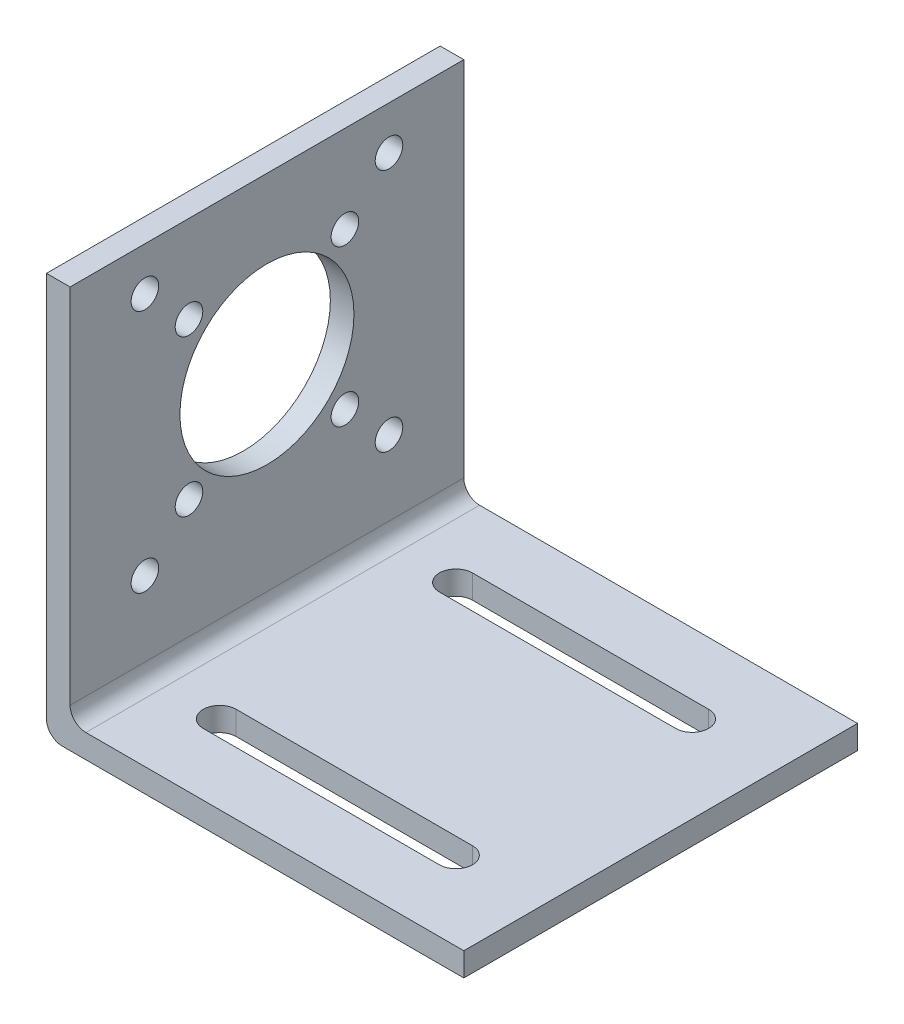
ISO-10303-21;
HEADER;
FILE_DESCRIPTION(('STEP AP214'),'2;1');
FILE_NAME('part.step','',(''),(''),'','','');
FILE_SCHEMA(('AUTOMOTIVE_DESIGN { 1 0 10303 214 1 1 1 1 }'));
ENDSEC;
DATA;
#1=APPLICATION_CONTEXT('core data for automotive mechanical design processes');
#2=APPLICATION_PROTOCOL_DEFINITION('international standard','automotive_design',2000,#1);
#3=PRODUCT_CONTEXT('',#1,'mechanical');
#4=PRODUCT('Part','Part','',(#3));
#5=PRODUCT_RELATED_PRODUCT_CATEGORY('part','',(#4));
#6=PRODUCT_DEFINITION_FORMATION('','',#4);
#7=PRODUCT_DEFINITION_CONTEXT('part definition',#1,'design');
#8=PRODUCT_DEFINITION('design','',#6,#7);
#9=PRODUCT_DEFINITION_SHAPE('','',#8);
#10=(LENGTH_UNIT() NAMED_UNIT(*) SI_UNIT(.MILLI.,.METRE.));
#11=(NAMED_UNIT(*) PLANE_ANGLE_UNIT() SI_UNIT($,.RADIAN.));
#12=(NAMED_UNIT(*) SI_UNIT($,.STERADIAN.) SOLID_ANGLE_UNIT());
#13=UNCERTAINTY_MEASURE_WITH_UNIT(LENGTH_MEASURE(1.E-05),#10,'distance_accuracy_value','');
#14=(GEOMETRIC_REPRESENTATION_CONTEXT(3) GLOBAL_UNCERTAINTY_ASSIGNED_CONTEXT((#13)) GLOBAL_UNIT_ASSIGNED_CONTEXT((#10,
#11,#12)) REPRESENTATION_CONTEXT('',''));
#15=CARTESIAN_POINT('',(0.,0.,0.));
#16=DIRECTION('',(0.,0.,1.));
#17=DIRECTION('',(1.,0.,0.));
#18=AXIS2_PLACEMENT_3D('',#15,#16,#17);
#19=CARTESIAN_POINT('',(0.,3.,0.));
#20=DIRECTION('',(0.,-1.,0.));
#21=DIRECTION('',(0.,0.,-1.));
#22=AXIS2_PLACEMENT_3D('',#19,#20,#21);
#23=PLANE('',#22);
#24=CARTESIAN_POINT('',(42.,3.,-40.));
#25=DIRECTION('',(0.,1.,0.));
#26=DIRECTION('',(0.,0.,1.));
#27=AXIS2_PLACEMENT_3D('',#24,#25,#26);
#28=CIRCLE('',#27,2.1);
#29=CARTESIAN_POINT('',(42.,3.,-37.9));
#30=VERTEX_POINT('',#29);
#31=CARTESIAN_POINT('',(42.,3.,-42.1));
#32=VERTEX_POINT('',#31);
#33=EDGE_CURVE('E231',#30,#32,#28,.T.);
#34=ORIENTED_EDGE('',*,*,#33,.F.);
#35=DIRECTION('',(1.,0.,0.));
#36=VECTOR('',#35,1.);
#37=CARTESIAN_POINT('',(0.,3.,-37.9));
#38=LINE('',#37,#36);
#39=CARTESIAN_POINT('',(12.,3.,-37.9));
#40=VERTEX_POINT('',#39);
#41=EDGE_CURVE('E202',#40,#30,#38,.T.);
#42=ORIENTED_EDGE('',*,*,#41,.F.);
#43=CARTESIAN_POINT('',(12.,3.,-40.));
#44=DIRECTION('',(0.,1.,0.));
#45=DIRECTION('',(0.,0.,1.));
#46=AXIS2_PLACEMENT_3D('',#43,#44,#45);
#47=CIRCLE('',#46,2.1);
#48=CARTESIAN_POINT('',(12.,3.,-42.1));
#49=VERTEX_POINT('',#48);
#50=EDGE_CURVE('E219',#49,#40,#47,.T.);
#51=ORIENTED_EDGE('',*,*,#50,.F.);
#52=DIRECTION('',(1.,0.,0.));
#53=VECTOR('',#52,1.);
#54=CARTESIAN_POINT('',(0.,3.,-42.1));
#55=LINE('',#54,#53);
#56=EDGE_CURVE('E222',#49,#32,#55,.T.);
#57=ORIENTED_EDGE('',*,*,#56,.T.);
#58=EDGE_LOOP('',(#34,#42,#51,#57));
#59=FACE_BOUND('',#58,.T.);
#60=DIRECTION('',(-1.,0.,0.));
#61=VECTOR('',#60,1.);
#62=CARTESIAN_POINT('',(0.,3.,-50.));
#63=LINE('',#62,#61);
#64=CARTESIAN_POINT('',(53.,3.,-50.));
#65=VERTEX_POINT('',#64);
#66=CARTESIAN_POINT('',(5.,3.,-50.));
#67=VERTEX_POINT('',#66);
#68=EDGE_CURVE('E294',#65,#67,#63,.T.);
#69=ORIENTED_EDGE('',*,*,#68,.T.);
#70=DIRECTION('',(0.,0.,-1.));
#71=VECTOR('',#70,1.);
#72=CARTESIAN_POINT('',(5.,3.,0.));
#73=LINE('',#72,#71);
#74=CARTESIAN_POINT('',(5.,3.,0.));
#75=VERTEX_POINT('',#74);
#76=EDGE_CURVE('E315',#67,#75,#73,.F.);
#77=ORIENTED_EDGE('',*,*,#76,.T.);
#78=DIRECTION('',(1.,0.,0.));
#79=VECTOR('',#78,1.);
#80=CARTESIAN_POINT('',(0.,3.,0.));
#81=LINE('',#80,#79);
#82=CARTESIAN_POINT('',(53.,3.,0.));
#83=VERTEX_POINT('',#82);
#84=EDGE_CURVE('E289',#75,#83,#81,.T.);
#85=ORIENTED_EDGE('',*,*,#84,.T.);
#86=DIRECTION('',(0.,0.,-1.));
#87=VECTOR('',#86,1.);
#88=CARTESIAN_POINT('',(53.,3.,0.));
#89=LINE('',#88,#87);
#90=EDGE_CURVE('E291',#83,#65,#89,.T.);
#91=ORIENTED_EDGE('',*,*,#90,.T.);
#92=EDGE_LOOP('',(#69,#77,#85,#91));
#93=FACE_BOUND('',#92,.T.);
#94=CARTESIAN_POINT('',(42.,3.,-10.));
#95=DIRECTION('',(0.,1.,0.));
#96=DIRECTION('',(0.,0.,1.));
#97=AXIS2_PLACEMENT_3D('',#94,#95,#96);
#98=CIRCLE('',#97,2.1);
#99=CARTESIAN_POINT('',(42.,3.,-12.1));
#100=VERTEX_POINT('',#99);
#101=CARTESIAN_POINT('',(42.,3.,-7.90000000000001));
#102=VERTEX_POINT('',#101);
#103=EDGE_CURVE('E254',#100,#102,#98,.F.);
#104=ORIENTED_EDGE('',*,*,#103,.T.);
#105=DIRECTION('',(1.,0.,0.));
#106=VECTOR('',#105,1.);
#107=CARTESIAN_POINT('',(0.,3.,-7.90000000000001));
#108=LINE('',#107,#106);
#109=CARTESIAN_POINT('',(12.,3.,-7.90000000000001));
#110=VERTEX_POINT('',#109);
#111=EDGE_CURVE('E245',#110,#102,#108,.T.);
#112=ORIENTED_EDGE('',*,*,#111,.F.);
#113=CARTESIAN_POINT('',(12.,3.,-10.));
#114=DIRECTION('',(0.,1.,0.));
#115=DIRECTION('',(0.,0.,1.));
#116=AXIS2_PLACEMENT_3D('',#113,#114,#115);
#117=CIRCLE('',#116,2.1);
#118=CARTESIAN_POINT('',(12.,3.,-12.1));
#119=VERTEX_POINT('',#118);
#120=EDGE_CURVE('E261',#110,#119,#117,.F.);
#121=ORIENTED_EDGE('',*,*,#120,.T.);
#122=DIRECTION('',(1.,0.,0.));
#123=VECTOR('',#122,1.);
#124=CARTESIAN_POINT('',(0.,3.,-12.1));
#125=LINE('',#124,#123);
#126=EDGE_CURVE('E257',#119,#100,#125,.T.);
#127=ORIENTED_EDGE('',*,*,#126,.T.);
#128=EDGE_LOOP('',(#104,#112,#121,#127));
#129=FACE_BOUND('',#128,.T.);
#130=ADVANCED_FACE('F82',(#59,#93,#129),#23,.F.);
#131=CARTESIAN_POINT('',(0.,0.,0.));
#132=DIRECTION('',(0.,-1.,0.));
#133=DIRECTION('',(0.,0.,-1.));
#134=AXIS2_PLACEMENT_3D('',#131,#132,#133);
#135=PLANE('',#134);
#136=DIRECTION('',(1.,0.,0.));
#137=VECTOR('',#136,1.);
#138=CARTESIAN_POINT('',(0.,0.,-37.9));
#139=LINE('',#138,#137);
#140=CARTESIAN_POINT('',(12.,0.,-37.9));
#141=VERTEX_POINT('',#140);
#142=CARTESIAN_POINT('',(42.,0.,-37.9));
#143=VERTEX_POINT('',#142);
#144=EDGE_CURVE('E199',#141,#143,#139,.T.);
#145=ORIENTED_EDGE('',*,*,#144,.T.);
#146=CARTESIAN_POINT('',(42.,0.,-40.));
#147=DIRECTION('',(0.,1.,0.));
#148=DIRECTION('',(0.,0.,1.));
#149=AXIS2_PLACEMENT_3D('',#146,#147,#148);
#150=CIRCLE('',#149,2.1);
#151=CARTESIAN_POINT('',(42.,0.,-42.1));
#152=VERTEX_POINT('',#151);
#153=EDGE_CURVE('E210',#143,#152,#150,.T.);
#154=ORIENTED_EDGE('',*,*,#153,.T.);
#155=DIRECTION('',(1.,0.,0.));
#156=VECTOR('',#155,1.);
#157=CARTESIAN_POINT('',(0.,0.,-42.1));
#158=LINE('',#157,#156);
#159=CARTESIAN_POINT('',(12.,0.,-42.1));
#160=VERTEX_POINT('',#159);
#161=EDGE_CURVE('E215',#160,#152,#158,.T.);
#162=ORIENTED_EDGE('',*,*,#161,.F.);
#163=CARTESIAN_POINT('',(12.,0.,-40.));
#164=DIRECTION('',(0.,1.,0.));
#165=DIRECTION('',(0.,0.,1.));
#166=AXIS2_PLACEMENT_3D('',#163,#164,#165);
#167=CIRCLE('',#166,2.1);
#168=EDGE_CURVE('E207',#160,#141,#167,.T.);
#169=ORIENTED_EDGE('',*,*,#168,.T.);
#170=EDGE_LOOP('',(#145,#154,#162,#169));
#171=FACE_BOUND('',#170,.T.);
#172=DIRECTION('',(1.,0.,0.));
#173=VECTOR('',#172,1.);
#174=CARTESIAN_POINT('',(0.,0.,0.));
#175=LINE('',#174,#173);
#176=CARTESIAN_POINT('',(2.,0.,0.));
#177=VERTEX_POINT('',#176);
#178=CARTESIAN_POINT('',(53.,0.,0.));
#179=VERTEX_POINT('',#178);
#180=EDGE_CURVE('E288',#177,#179,#175,.T.);
#181=ORIENTED_EDGE('',*,*,#180,.F.);
#182=DIRECTION('',(0.,0.,1.));
#183=VECTOR('',#182,1.);
#184=CARTESIAN_POINT('',(2.,0.,-50.));
#185=LINE('',#184,#183);
#186=CARTESIAN_POINT('',(2.,0.,-50.));
#187=VERTEX_POINT('',#186);
#188=EDGE_CURVE('E97',#177,#187,#185,.F.);
#189=ORIENTED_EDGE('',*,*,#188,.T.);
#190=DIRECTION('',(-1.,0.,0.));
#191=VECTOR('',#190,1.);
#192=CARTESIAN_POINT('',(0.,0.,-50.));
#193=LINE('',#192,#191);
#194=CARTESIAN_POINT('',(53.,0.,-50.));
#195=VERTEX_POINT('',#194);
#196=EDGE_CURVE('E292',#195,#187,#193,.T.);
#197=ORIENTED_EDGE('',*,*,#196,.F.);
#198=DIRECTION('',(0.,0.,-1.));
#199=VECTOR('',#198,1.);
#200=CARTESIAN_POINT('',(53.,0.,0.));
#201=LINE('',#200,#199);
#202=EDGE_CURVE('E299',#179,#195,#201,.T.);
#203=ORIENTED_EDGE('',*,*,#202,.F.);
#204=EDGE_LOOP('',(#181,#189,#197,#203));
#205=FACE_BOUND('',#204,.T.);
#206=DIRECTION('',(1.,0.,0.));
#207=VECTOR('',#206,1.);
#208=CARTESIAN_POINT('',(0.,0.,-7.90000000000001));
#209=LINE('',#208,#207);
#210=CARTESIAN_POINT('',(12.,0.,-7.90000000000001));
#211=VERTEX_POINT('',#210);
#212=CARTESIAN_POINT('',(42.,0.,-7.90000000000001));
#213=VERTEX_POINT('',#212);
#214=EDGE_CURVE('E250',#211,#213,#209,.T.);
#215=ORIENTED_EDGE('',*,*,#214,.T.);
#216=CARTESIAN_POINT('',(42.,0.,-10.));
#217=DIRECTION('',(0.,1.,0.));
#218=DIRECTION('',(0.,0.,1.));
#219=AXIS2_PLACEMENT_3D('',#216,#217,#218);
#220=CIRCLE('',#219,2.1);
#221=CARTESIAN_POINT('',(42.,0.,-12.1));
#222=VERTEX_POINT('',#221);
#223=EDGE_CURVE('E242',#222,#213,#220,.F.);
#224=ORIENTED_EDGE('',*,*,#223,.F.);
#225=DIRECTION('',(1.,0.,0.));
#226=VECTOR('',#225,1.);
#227=CARTESIAN_POINT('',(0.,0.,-12.1));
#228=LINE('',#227,#226);
#229=CARTESIAN_POINT('',(12.,0.,-12.1));
#230=VERTEX_POINT('',#229);
#231=EDGE_CURVE('E244',#230,#222,#228,.T.);
#232=ORIENTED_EDGE('',*,*,#231,.F.);
#233=CARTESIAN_POINT('',(12.,0.,-10.));
#234=DIRECTION('',(0.,1.,0.));
#235=DIRECTION('',(0.,0.,1.));
#236=AXIS2_PLACEMENT_3D('',#233,#234,#235);
#237=CIRCLE('',#236,2.1);
#238=EDGE_CURVE('E247',#211,#230,#237,.F.);
#239=ORIENTED_EDGE('',*,*,#238,.F.);
#240=EDGE_LOOP('',(#215,#224,#232,#239));
#241=FACE_BOUND('',#240,.T.);
#242=ADVANCED_FACE('F217',(#171,#205,#241),#135,.T.);
#243=CARTESIAN_POINT('',(0.,3.,0.));
#244=DIRECTION('',(1.,0.,0.));
#245=DIRECTION('',(0.,0.,-1.));
#246=AXIS2_PLACEMENT_3D('',#243,#244,#245);
#247=PLANE('',#246);
#248=CARTESIAN_POINT('',(0.,14.5,-9.5));
#249=DIRECTION('',(1.,0.,0.));
#250=DIRECTION('',(0.,0.,-1.));
#251=AXIS2_PLACEMENT_3D('',#248,#249,#250);
#252=CIRCLE('',#251,1.75);
#253=CARTESIAN_POINT('',(0.,14.5,-11.25));
#254=VERTEX_POINT('',#253);
#255=EDGE_CURVE('E451',#254,#254,#252,.T.);
#256=ORIENTED_EDGE('',*,*,#255,.T.);
#257=EDGE_LOOP('',(#256));
#258=FACE_BOUND('',#257,.T.);
#259=CARTESIAN_POINT('',(0.,20.1,-15.1010101525459));
#260=DIRECTION('',(1.,0.,0.));
#261=DIRECTION('',(0.,0.,-1.));
#262=AXIS2_PLACEMENT_3D('',#259,#260,#261);
#263=CIRCLE('',#262,1.75);
#264=CARTESIAN_POINT('',(0.,20.1,-16.8510101525459));
#265=VERTEX_POINT('',#264);
#266=EDGE_CURVE('E480',#265,#265,#263,.T.);
#267=ORIENTED_EDGE('',*,*,#266,.T.);
#268=EDGE_LOOP('',(#267));
#269=FACE_BOUND('',#268,.T.);
#270=CARTESIAN_POINT('',(0.,39.9,-15.1010101525459));
#271=DIRECTION('',(1.,0.,0.));
#272=DIRECTION('',(0.,0.,-1.));
#273=AXIS2_PLACEMENT_3D('',#270,#271,#272);
#274=CIRCLE('',#273,1.75);
#275=CARTESIAN_POINT('',(0.,39.9,-16.8510101525459));
#276=VERTEX_POINT('',#275);
#277=EDGE_CURVE('E488',#276,#276,#274,.T.);
#278=ORIENTED_EDGE('',*,*,#277,.T.);
#279=EDGE_LOOP('',(#278));
#280=FACE_BOUND('',#279,.T.);
#281=CARTESIAN_POINT('',(0.,30.,-25.));
#282=DIRECTION('',(1.,0.,0.));
#283=DIRECTION('',(0.,0.,-1.));
#284=AXIS2_PLACEMENT_3D('',#281,#282,#283);
#285=CIRCLE('',#284,11.05);
#286=CARTESIAN_POINT('',(0.,30.,-36.05));
#287=VERTEX_POINT('',#286);
#288=EDGE_CURVE('E479',#287,#287,#285,.T.);
#289=ORIENTED_EDGE('',*,*,#288,.T.);
#290=EDGE_LOOP('',(#289));
#291=FACE_BOUND('',#290,.T.);
#292=CARTESIAN_POINT('',(0.,20.1,-34.8989898474541));
#293=DIRECTION('',(1.,0.,0.));
#294=DIRECTION('',(0.,0.,-1.));
#295=AXIS2_PLACEMENT_3D('',#292,#293,#294);
#296=CIRCLE('',#295,1.75);
#297=CARTESIAN_POINT('',(0.,20.1,-36.6489898474541));
#298=VERTEX_POINT('',#297);
#299=EDGE_CURVE('E446',#298,#298,#296,.T.);
#300=ORIENTED_EDGE('',*,*,#299,.T.);
#301=EDGE_LOOP('',(#300));
#302=FACE_BOUND('',#301,.T.);
#303=CARTESIAN_POINT('',(0.,14.5,-40.5));
#304=DIRECTION('',(1.,0.,0.));
#305=DIRECTION('',(0.,0.,-1.));
#306=AXIS2_PLACEMENT_3D('',#303,#304,#305);
#307=CIRCLE('',#306,1.75);
#308=CARTESIAN_POINT('',(0.,14.5,-42.25));
#309=VERTEX_POINT('',#308);
#310=EDGE_CURVE('E461',#309,#309,#307,.T.);
#311=ORIENTED_EDGE('',*,*,#310,.T.);
#312=EDGE_LOOP('',(#311));
#313=FACE_BOUND('',#312,.T.);
#314=CARTESIAN_POINT('',(0.,39.9,-34.8989898474541));
#315=DIRECTION('',(1.,0.,0.));
#316=DIRECTION('',(0.,0.,-1.));
#317=AXIS2_PLACEMENT_3D('',#314,#315,#316);
#318=CIRCLE('',#317,1.75);
#319=CARTESIAN_POINT('',(0.,39.9,-36.6489898474541));
#320=VERTEX_POINT('',#319);
#321=EDGE_CURVE('E467',#320,#320,#318,.T.);
#322=ORIENTED_EDGE('',*,*,#321,.T.);
#323=EDGE_LOOP('',(#322));
#324=FACE_BOUND('',#323,.T.);
#325=CARTESIAN_POINT('',(0.,45.5,-40.5));
#326=DIRECTION('',(1.,0.,0.));
#327=DIRECTION('',(0.,0.,-1.));
#328=AXIS2_PLACEMENT_3D('',#325,#326,#327);
#329=CIRCLE('',#328,1.75);
#330=CARTESIAN_POINT('',(0.,45.5,-42.25));
#331=VERTEX_POINT('',#330);
#332=EDGE_CURVE('E473',#331,#331,#329,.T.);
#333=ORIENTED_EDGE('',*,*,#332,.T.);
#334=EDGE_LOOP('',(#333));
#335=FACE_BOUND('',#334,.T.);
#336=CARTESIAN_POINT('',(0.,45.5,-9.5));
#337=DIRECTION('',(1.,0.,0.));
#338=DIRECTION('',(0.,0.,-1.));
#339=AXIS2_PLACEMENT_3D('',#336,#337,#338);
#340=CIRCLE('',#339,1.75);
#341=CARTESIAN_POINT('',(0.,45.5,-11.25));
#342=VERTEX_POINT('',#341);
#343=EDGE_CURVE('E258',#342,#342,#340,.T.);
#344=ORIENTED_EDGE('',*,*,#343,.T.);
#345=EDGE_LOOP('',(#344));
#346=FACE_BOUND('',#345,.T.);
#347=DIRECTION('',(0.,-1.,0.));
#348=VECTOR('',#347,1.);
#349=CARTESIAN_POINT('',(0.,3.,-50.));
#350=LINE('',#349,#348);
#351=CARTESIAN_POINT('',(0.,51.,-50.));
#352=VERTEX_POINT('',#351);
#353=CARTESIAN_POINT('',(0.,2.,-50.));
#354=VERTEX_POINT('',#353);
#355=EDGE_CURVE('E297',#352,#354,#350,.T.);
#356=ORIENTED_EDGE('',*,*,#355,.T.);
#357=DIRECTION('',(0.,0.,1.));
#358=VECTOR('',#357,1.);
#359=CARTESIAN_POINT('',(0.,2.,0.));
#360=LINE('',#359,#358);
#361=CARTESIAN_POINT('',(0.,2.,0.));
#362=VERTEX_POINT('',#361);
#363=EDGE_CURVE('E317',#354,#362,#360,.T.);
#364=ORIENTED_EDGE('',*,*,#363,.T.);
#365=DIRECTION('',(0.,-1.,0.));
#366=VECTOR('',#365,1.);
#367=CARTESIAN_POINT('',(0.,3.,0.));
#368=LINE('',#367,#366);
#369=CARTESIAN_POINT('',(0.,51.,0.));
#370=VERTEX_POINT('',#369);
#371=EDGE_CURVE('E310',#370,#362,#368,.T.);
#372=ORIENTED_EDGE('',*,*,#371,.F.);
#373=DIRECTION('',(0.,0.,1.));
#374=VECTOR('',#373,1.);
#375=CARTESIAN_POINT('',(0.,51.,0.));
#376=LINE('',#375,#374);
#377=EDGE_CURVE('E238',#352,#370,#376,.T.);
#378=ORIENTED_EDGE('',*,*,#377,.F.);
#379=EDGE_LOOP('',(#356,#364,#372,#378));
#380=FACE_BOUND('',#379,.T.);
#381=ADVANCED_FACE('F349',(#258,#269,#280,#291,#302,#313,#324,#335,#346,#380),#247,.F.);
#382=CARTESIAN_POINT('',(0.,3.,0.));
#383=DIRECTION('',(0.,0.,-1.));
#384=DIRECTION('',(-1.,0.,0.));
#385=AXIS2_PLACEMENT_3D('',#382,#383,#384);
#386=PLANE('',#385);
#387=ORIENTED_EDGE('',*,*,#371,.T.);
#388=CARTESIAN_POINT('',(2.,2.,0.));
#389=DIRECTION('',(0.,0.,-1.));
#390=DIRECTION('',(-1.,0.,0.));
#391=AXIS2_PLACEMENT_3D('',#388,#389,#390);
#392=CIRCLE('',#391,2.);
#393=EDGE_CURVE('E105',#362,#177,#392,.F.);
#394=ORIENTED_EDGE('',*,*,#393,.T.);
#395=ORIENTED_EDGE('',*,*,#180,.T.);
#396=DIRECTION('',(0.,-1.,0.));
#397=VECTOR('',#396,1.);
#398=CARTESIAN_POINT('',(53.,3.,0.));
#399=LINE('',#398,#397);
#400=EDGE_CURVE('E307',#83,#179,#399,.T.);
#401=ORIENTED_EDGE('',*,*,#400,.F.);
#402=ORIENTED_EDGE('',*,*,#84,.F.);
#403=CARTESIAN_POINT('',(5.,5.,0.));
#404=DIRECTION('',(0.,0.,-1.));
#405=DIRECTION('',(-1.,0.,0.));
#406=AXIS2_PLACEMENT_3D('',#403,#404,#405);
#407=CIRCLE('',#406,2.);
#408=CARTESIAN_POINT('',(3.,5.,0.));
#409=VERTEX_POINT('',#408);
#410=EDGE_CURVE('E14',#75,#409,#407,.T.);
#411=ORIENTED_EDGE('',*,*,#410,.T.);
#412=DIRECTION('',(0.,-1.,0.));
#413=VECTOR('',#412,1.);
#414=CARTESIAN_POINT('',(3.,51.,0.));
#415=LINE('',#414,#413);
#416=CARTESIAN_POINT('',(3.,51.,0.));
#417=VERTEX_POINT('',#416);
#418=EDGE_CURVE('E285',#417,#409,#415,.T.);
#419=ORIENTED_EDGE('',*,*,#418,.F.);
#420=DIRECTION('',(1.,0.,0.));
#421=VECTOR('',#420,1.);
#422=CARTESIAN_POINT('',(0.,51.,0.));
#423=LINE('',#422,#421);
#424=EDGE_CURVE('E275',#370,#417,#423,.T.);
#425=ORIENTED_EDGE('',*,*,#424,.F.);
#426=EDGE_LOOP('',(#387,#394,#395,#401,#402,#411,#419,#425));
#427=FACE_BOUND('',#426,.T.);
#428=ADVANCED_FACE('F339',(#427),#386,.F.);
#429=CARTESIAN_POINT('',(53.,3.,0.));
#430=DIRECTION('',(-1.,0.,0.));
#431=DIRECTION('',(0.,0.,1.));
#432=AXIS2_PLACEMENT_3D('',#429,#430,#431);
#433=PLANE('',#432);
#434=ORIENTED_EDGE('',*,*,#202,.T.);
#435=DIRECTION('',(0.,-1.,0.));
#436=VECTOR('',#435,1.);
#437=CARTESIAN_POINT('',(53.,3.,-50.));
#438=LINE('',#437,#436);
#439=EDGE_CURVE('E304',#65,#195,#438,.T.);
#440=ORIENTED_EDGE('',*,*,#439,.F.);
#441=ORIENTED_EDGE('',*,*,#90,.F.);
#442=ORIENTED_EDGE('',*,*,#400,.T.);
#443=EDGE_LOOP('',(#434,#440,#441,#442));
#444=FACE_BOUND('',#443,.T.);
#445=ADVANCED_FACE('F356',(#444),#433,.F.);
#446=CARTESIAN_POINT('',(0.,3.,-50.));
#447=DIRECTION('',(0.,0.,1.));
#448=DIRECTION('',(1.,0.,0.));
#449=AXIS2_PLACEMENT_3D('',#446,#447,#448);
#450=PLANE('',#449);
#451=ORIENTED_EDGE('',*,*,#196,.T.);
#452=CARTESIAN_POINT('',(2.,2.,-50.));
#453=DIRECTION('',(0.,0.,1.));
#454=DIRECTION('',(1.,0.,0.));
#455=AXIS2_PLACEMENT_3D('',#452,#453,#454);
#456=CIRCLE('',#455,2.);
#457=EDGE_CURVE('E322',#187,#354,#456,.F.);
#458=ORIENTED_EDGE('',*,*,#457,.T.);
#459=ORIENTED_EDGE('',*,*,#355,.F.);
#460=DIRECTION('',(-1.,0.,0.));
#461=VECTOR('',#460,1.);
#462=CARTESIAN_POINT('',(0.,51.,-50.));
#463=LINE('',#462,#461);
#464=CARTESIAN_POINT('',(3.,51.,-50.));
#465=VERTEX_POINT('',#464);
#466=EDGE_CURVE('E279',#465,#352,#463,.T.);
#467=ORIENTED_EDGE('',*,*,#466,.F.);
#468=DIRECTION('',(0.,-1.,0.));
#469=VECTOR('',#468,1.);
#470=CARTESIAN_POINT('',(3.,51.,-50.));
#471=LINE('',#470,#469);
#472=CARTESIAN_POINT('',(3.,5.,-50.));
#473=VERTEX_POINT('',#472);
#474=EDGE_CURVE('E282',#465,#473,#471,.T.);
#475=ORIENTED_EDGE('',*,*,#474,.T.);
#476=CARTESIAN_POINT('',(5.,5.,-50.));
#477=DIRECTION('',(0.,0.,1.));
#478=DIRECTION('',(1.,0.,0.));
#479=AXIS2_PLACEMENT_3D('',#476,#477,#478);
#480=CIRCLE('',#479,2.);
#481=EDGE_CURVE('E90',#473,#67,#480,.T.);
#482=ORIENTED_EDGE('',*,*,#481,.T.);
#483=ORIENTED_EDGE('',*,*,#68,.F.);
#484=ORIENTED_EDGE('',*,*,#439,.T.);
#485=EDGE_LOOP('',(#451,#458,#459,#467,#475,#482,#483,#484));
#486=FACE_BOUND('',#485,.T.);
#487=ADVANCED_FACE('F325',(#486),#450,.F.);
#488=CARTESIAN_POINT('',(3.,51.,0.));
#489=DIRECTION('',(-1.,0.,0.));
#490=DIRECTION('',(0.,0.,1.));
#491=AXIS2_PLACEMENT_3D('',#488,#489,#490);
#492=PLANE('',#491);
#493=CARTESIAN_POINT('',(3.,14.5,-9.5));
#494=DIRECTION('',(1.,0.,0.));
#495=DIRECTION('',(0.,0.,-1.));
#496=AXIS2_PLACEMENT_3D('',#493,#494,#495);
#497=CIRCLE('',#496,1.75);
#498=CARTESIAN_POINT('',(3.,14.5,-11.25));
#499=VERTEX_POINT('',#498);
#500=EDGE_CURVE('E454',#499,#499,#497,.T.);
#501=ORIENTED_EDGE('',*,*,#500,.F.);
#502=EDGE_LOOP('',(#501));
#503=FACE_BOUND('',#502,.T.);
#504=CARTESIAN_POINT('',(3.,20.1,-15.1010101525459));
#505=DIRECTION('',(1.,0.,0.));
#506=DIRECTION('',(0.,0.,-1.));
#507=AXIS2_PLACEMENT_3D('',#504,#505,#506);
#508=CIRCLE('',#507,1.75);
#509=CARTESIAN_POINT('',(3.,20.1,-16.8510101525459));
#510=VERTEX_POINT('',#509);
#511=EDGE_CURVE('E476',#510,#510,#508,.T.);
#512=ORIENTED_EDGE('',*,*,#511,.F.);
#513=EDGE_LOOP('',(#512));
#514=FACE_BOUND('',#513,.T.);
#515=CARTESIAN_POINT('',(3.,39.9,-15.1010101525459));
#516=DIRECTION('',(1.,0.,0.));
#517=DIRECTION('',(0.,0.,-1.));
#518=AXIS2_PLACEMENT_3D('',#515,#516,#517);
#519=CIRCLE('',#518,1.75);
#520=CARTESIAN_POINT('',(3.,39.9,-16.8510101525459));
#521=VERTEX_POINT('',#520);
#522=EDGE_CURVE('E491',#521,#521,#519,.T.);
#523=ORIENTED_EDGE('',*,*,#522,.F.);
#524=EDGE_LOOP('',(#523));
#525=FACE_BOUND('',#524,.T.);
#526=CARTESIAN_POINT('',(3.,30.,-25.));
#527=DIRECTION('',(1.,0.,0.));
#528=DIRECTION('',(0.,0.,-1.));
#529=AXIS2_PLACEMENT_3D('',#526,#527,#528);
#530=CIRCLE('',#529,11.05);
#531=CARTESIAN_POINT('',(3.,30.,-36.05));
#532=VERTEX_POINT('',#531);
#533=EDGE_CURVE('E485',#532,#532,#530,.T.);
#534=ORIENTED_EDGE('',*,*,#533,.F.);
#535=EDGE_LOOP('',(#534));
#536=FACE_BOUND('',#535,.T.);
#537=CARTESIAN_POINT('',(3.,20.1,-34.8989898474541));
#538=DIRECTION('',(1.,0.,0.));
#539=DIRECTION('',(0.,0.,-1.));
#540=AXIS2_PLACEMENT_3D('',#537,#538,#539);
#541=CIRCLE('',#540,1.75);
#542=CARTESIAN_POINT('',(3.,20.1,-36.6489898474541));
#543=VERTEX_POINT('',#542);
#544=EDGE_CURVE('E449',#543,#543,#541,.T.);
#545=ORIENTED_EDGE('',*,*,#544,.F.);
#546=EDGE_LOOP('',(#545));
#547=FACE_BOUND('',#546,.T.);
#548=CARTESIAN_POINT('',(3.,14.5,-40.5));
#549=DIRECTION('',(1.,0.,0.));
#550=DIRECTION('',(0.,0.,-1.));
#551=AXIS2_PLACEMENT_3D('',#548,#549,#550);
#552=CIRCLE('',#551,1.75);
#553=CARTESIAN_POINT('',(3.,14.5,-42.25));
#554=VERTEX_POINT('',#553);
#555=EDGE_CURVE('E456',#554,#554,#552,.T.);
#556=ORIENTED_EDGE('',*,*,#555,.F.);
#557=EDGE_LOOP('',(#556));
#558=FACE_BOUND('',#557,.T.);
#559=CARTESIAN_POINT('',(3.,39.9,-34.8989898474541));
#560=DIRECTION('',(1.,0.,0.));
#561=DIRECTION('',(0.,0.,-1.));
#562=AXIS2_PLACEMENT_3D('',#559,#560,#561);
#563=CIRCLE('',#562,1.75);
#564=CARTESIAN_POINT('',(3.,39.9,-36.6489898474541));
#565=VERTEX_POINT('',#564);
#566=EDGE_CURVE('E464',#565,#565,#563,.T.);
#567=ORIENTED_EDGE('',*,*,#566,.F.);
#568=EDGE_LOOP('',(#567));
#569=FACE_BOUND('',#568,.T.);
#570=CARTESIAN_POINT('',(3.,45.5,-40.5));
#571=DIRECTION('',(1.,0.,0.));
#572=DIRECTION('',(0.,0.,-1.));
#573=AXIS2_PLACEMENT_3D('',#570,#571,#572);
#574=CIRCLE('',#573,1.75);
#575=CARTESIAN_POINT('',(3.,45.5,-42.25));
#576=VERTEX_POINT('',#575);
#577=EDGE_CURVE('E470',#576,#576,#574,.T.);
#578=ORIENTED_EDGE('',*,*,#577,.F.);
#579=EDGE_LOOP('',(#578));
#580=FACE_BOUND('',#579,.T.);
#581=CARTESIAN_POINT('',(3.,45.5,-9.5));
#582=DIRECTION('',(1.,0.,0.));
#583=DIRECTION('',(0.,0.,-1.));
#584=AXIS2_PLACEMENT_3D('',#581,#582,#583);
#585=CIRCLE('',#584,1.75);
#586=CARTESIAN_POINT('',(3.,45.5,-11.25));
#587=VERTEX_POINT('',#586);
#588=EDGE_CURVE('E225',#587,#587,#585,.T.);
#589=ORIENTED_EDGE('',*,*,#588,.F.);
#590=EDGE_LOOP('',(#589));
#591=FACE_BOUND('',#590,.T.);
#592=ORIENTED_EDGE('',*,*,#418,.T.);
#593=DIRECTION('',(0.,0.,-1.));
#594=VECTOR('',#593,1.);
#595=CARTESIAN_POINT('',(3.,5.,-50.));
#596=LINE('',#595,#594);
#597=EDGE_CURVE('E312',#409,#473,#596,.T.);
#598=ORIENTED_EDGE('',*,*,#597,.T.);
#599=ORIENTED_EDGE('',*,*,#474,.F.);
#600=DIRECTION('',(0.,0.,-1.));
#601=VECTOR('',#600,1.);
#602=CARTESIAN_POINT('',(3.,51.,0.));
#603=LINE('',#602,#601);
#604=EDGE_CURVE('E277',#417,#465,#603,.T.);
#605=ORIENTED_EDGE('',*,*,#604,.F.);
#606=EDGE_LOOP('',(#592,#598,#599,#605));
#607=FACE_BOUND('',#606,.T.);
#608=ADVANCED_FACE('F344',(#503,#514,#525,#536,#547,#558,#569,#580,#591,#607),#492,.F.);
#609=CARTESIAN_POINT('',(0.,51.,0.));
#610=DIRECTION('',(0.,-1.,0.));
#611=DIRECTION('',(0.,0.,-1.));
#612=AXIS2_PLACEMENT_3D('',#609,#610,#611);
#613=PLANE('',#612);
#614=ORIENTED_EDGE('',*,*,#377,.T.);
#615=ORIENTED_EDGE('',*,*,#424,.T.);
#616=ORIENTED_EDGE('',*,*,#604,.T.);
#617=ORIENTED_EDGE('',*,*,#466,.T.);
#618=EDGE_LOOP('',(#614,#615,#616,#617));
#619=FACE_BOUND('',#618,.T.);
#620=ADVANCED_FACE('F346',(#619),#613,.F.);
#621=CARTESIAN_POINT('',(42.,0.,-10.));
#622=DIRECTION('',(0.,1.,0.));
#623=DIRECTION('',(0.,0.,1.));
#624=AXIS2_PLACEMENT_3D('',#621,#622,#623);
#625=CYLINDRICAL_SURFACE('',#624,2.1);
#626=ORIENTED_EDGE('',*,*,#103,.F.);
#627=DIRECTION('',(0.,1.,0.));
#628=VECTOR('',#627,1.);
#629=CARTESIAN_POINT('',(42.,0.,-12.1));
#630=LINE('',#629,#628);
#631=EDGE_CURVE('E253',#222,#100,#630,.T.);
#632=ORIENTED_EDGE('',*,*,#631,.F.);
#633=ORIENTED_EDGE('',*,*,#223,.T.);
#634=DIRECTION('',(0.,1.,0.));
#635=VECTOR('',#634,1.);
#636=CARTESIAN_POINT('',(42.,0.,-7.90000000000001));
#637=LINE('',#636,#635);
#638=EDGE_CURVE('E232',#213,#102,#637,.T.);
#639=ORIENTED_EDGE('',*,*,#638,.T.);
#640=EDGE_LOOP('',(#626,#632,#633,#639));
#641=FACE_BOUND('',#640,.T.);
#642=ADVANCED_FACE('F378',(#641),#625,.F.);
#643=CARTESIAN_POINT('',(0.,0.,-7.90000000000001));
#644=DIRECTION('',(0.,0.,1.));
#645=DIRECTION('',(1.,0.,0.));
#646=AXIS2_PLACEMENT_3D('',#643,#644,#645);
#647=PLANE('',#646);
#648=ORIENTED_EDGE('',*,*,#111,.T.);
#649=ORIENTED_EDGE('',*,*,#638,.F.);
#650=ORIENTED_EDGE('',*,*,#214,.F.);
#651=DIRECTION('',(0.,1.,0.));
#652=VECTOR('',#651,1.);
#653=CARTESIAN_POINT('',(12.,0.,-7.90000000000001));
#654=LINE('',#653,#652);
#655=EDGE_CURVE('E267',#211,#110,#654,.T.);
#656=ORIENTED_EDGE('',*,*,#655,.T.);
#657=EDGE_LOOP('',(#648,#649,#650,#656));
#658=FACE_BOUND('',#657,.T.);
#659=ADVANCED_FACE('F381',(#658),#647,.F.);
#660=CARTESIAN_POINT('',(12.,0.,-10.));
#661=DIRECTION('',(0.,1.,0.));
#662=DIRECTION('',(0.,0.,1.));
#663=AXIS2_PLACEMENT_3D('',#660,#661,#662);
#664=CYLINDRICAL_SURFACE('',#663,2.1);
#665=ORIENTED_EDGE('',*,*,#120,.F.);
#666=ORIENTED_EDGE('',*,*,#655,.F.);
#667=ORIENTED_EDGE('',*,*,#238,.T.);
#668=DIRECTION('',(0.,1.,0.));
#669=VECTOR('',#668,1.);
#670=CARTESIAN_POINT('',(12.,0.,-12.1));
#671=LINE('',#670,#669);
#672=EDGE_CURVE('E269',#230,#119,#671,.T.);
#673=ORIENTED_EDGE('',*,*,#672,.T.);
#674=EDGE_LOOP('',(#665,#666,#667,#673));
#675=FACE_BOUND('',#674,.T.);
#676=ADVANCED_FACE('F386',(#675),#664,.F.);
#677=CARTESIAN_POINT('',(0.,0.,-12.1));
#678=DIRECTION('',(0.,0.,1.));
#679=DIRECTION('',(1.,0.,0.));
#680=AXIS2_PLACEMENT_3D('',#677,#678,#679);
#681=PLANE('',#680);
#682=ORIENTED_EDGE('',*,*,#126,.F.);
#683=ORIENTED_EDGE('',*,*,#672,.F.);
#684=ORIENTED_EDGE('',*,*,#231,.T.);
#685=ORIENTED_EDGE('',*,*,#631,.T.);
#686=EDGE_LOOP('',(#682,#683,#684,#685));
#687=FACE_BOUND('',#686,.T.);
#688=ADVANCED_FACE('F383',(#687),#681,.T.);
#689=CARTESIAN_POINT('',(0.,0.,-37.9));
#690=DIRECTION('',(0.,0.,1.));
#691=DIRECTION('',(1.,0.,0.));
#692=AXIS2_PLACEMENT_3D('',#689,#690,#691);
#693=PLANE('',#692);
#694=ORIENTED_EDGE('',*,*,#41,.T.);
#695=DIRECTION('',(0.,1.,0.));
#696=VECTOR('',#695,1.);
#697=CARTESIAN_POINT('',(42.,0.,-37.9));
#698=LINE('',#697,#696);
#699=EDGE_CURVE('E195',#143,#30,#698,.T.);
#700=ORIENTED_EDGE('',*,*,#699,.F.);
#701=ORIENTED_EDGE('',*,*,#144,.F.);
#702=DIRECTION('',(0.,1.,0.));
#703=VECTOR('',#702,1.);
#704=CARTESIAN_POINT('',(12.,0.,-37.9));
#705=LINE('',#704,#703);
#706=EDGE_CURVE('E236',#141,#40,#705,.T.);
#707=ORIENTED_EDGE('',*,*,#706,.T.);
#708=EDGE_LOOP('',(#694,#700,#701,#707));
#709=FACE_BOUND('',#708,.T.);
#710=ADVANCED_FACE('F197',(#709),#693,.F.);
#711=CARTESIAN_POINT('',(12.,0.,-40.));
#712=DIRECTION('',(0.,1.,0.));
#713=DIRECTION('',(0.,0.,1.));
#714=AXIS2_PLACEMENT_3D('',#711,#712,#713);
#715=CYLINDRICAL_SURFACE('',#714,2.1);
#716=ORIENTED_EDGE('',*,*,#50,.T.);
#717=ORIENTED_EDGE('',*,*,#706,.F.);
#718=ORIENTED_EDGE('',*,*,#168,.F.);
#719=DIRECTION('',(0.,1.,0.));
#720=VECTOR('',#719,1.);
#721=CARTESIAN_POINT('',(12.,0.,-42.1));
#722=LINE('',#721,#720);
#723=EDGE_CURVE('E239',#160,#49,#722,.T.);
#724=ORIENTED_EDGE('',*,*,#723,.T.);
#725=EDGE_LOOP('',(#716,#717,#718,#724));
#726=FACE_BOUND('',#725,.T.);
#727=ADVANCED_FACE('F396',(#726),#715,.F.);
#728=CARTESIAN_POINT('',(0.,0.,-42.1));
#729=DIRECTION('',(0.,0.,1.));
#730=DIRECTION('',(1.,0.,0.));
#731=AXIS2_PLACEMENT_3D('',#728,#729,#730);
#732=PLANE('',#731);
#733=ORIENTED_EDGE('',*,*,#56,.F.);
#734=ORIENTED_EDGE('',*,*,#723,.F.);
#735=ORIENTED_EDGE('',*,*,#161,.T.);
#736=DIRECTION('',(0.,1.,0.));
#737=VECTOR('',#736,1.);
#738=CARTESIAN_POINT('',(42.,0.,-42.1));
#739=LINE('',#738,#737);
#740=EDGE_CURVE('E206',#152,#32,#739,.T.);
#741=ORIENTED_EDGE('',*,*,#740,.T.);
#742=EDGE_LOOP('',(#733,#734,#735,#741));
#743=FACE_BOUND('',#742,.T.);
#744=ADVANCED_FACE('F399',(#743),#732,.T.);
#745=CARTESIAN_POINT('',(42.,0.,-40.));
#746=DIRECTION('',(0.,1.,0.));
#747=DIRECTION('',(0.,0.,1.));
#748=AXIS2_PLACEMENT_3D('',#745,#746,#747);
#749=CYLINDRICAL_SURFACE('',#748,2.1);
#750=ORIENTED_EDGE('',*,*,#33,.T.);
#751=ORIENTED_EDGE('',*,*,#740,.F.);
#752=ORIENTED_EDGE('',*,*,#153,.F.);
#753=ORIENTED_EDGE('',*,*,#699,.T.);
#754=EDGE_LOOP('',(#750,#751,#752,#753));
#755=FACE_BOUND('',#754,.T.);
#756=ADVANCED_FACE('F211',(#755),#749,.F.);
#757=CARTESIAN_POINT('',(5.,5.,0.));
#758=DIRECTION('',(0.,0.,1.));
#759=DIRECTION('',(1.,0.,0.));
#760=AXIS2_PLACEMENT_3D('',#757,#758,#759);
#761=CYLINDRICAL_SURFACE('',#760,2.);
#762=ORIENTED_EDGE('',*,*,#410,.F.);
#763=ORIENTED_EDGE('',*,*,#76,.F.);
#764=ORIENTED_EDGE('',*,*,#481,.F.);
#765=ORIENTED_EDGE('',*,*,#597,.F.);
#766=EDGE_LOOP('',(#762,#763,#764,#765));
#767=FACE_BOUND('',#766,.T.);
#768=ADVANCED_FACE('F337',(#767),#761,.F.);
#769=CARTESIAN_POINT('',(2.,2.,0.));
#770=DIRECTION('',(0.,0.,-1.));
#771=DIRECTION('',(-1.,0.,0.));
#772=AXIS2_PLACEMENT_3D('',#769,#770,#771);
#773=CYLINDRICAL_SURFACE('',#772,2.);
#774=ORIENTED_EDGE('',*,*,#457,.F.);
#775=ORIENTED_EDGE('',*,*,#188,.F.);
#776=ORIENTED_EDGE('',*,*,#393,.F.);
#777=ORIENTED_EDGE('',*,*,#363,.F.);
#778=EDGE_LOOP('',(#774,#775,#776,#777));
#779=FACE_BOUND('',#778,.T.);
#780=ADVANCED_FACE('F84',(#779),#773,.T.);
#781=CARTESIAN_POINT('',(0.,45.5,-9.5));
#782=DIRECTION('',(1.,0.,0.));
#783=DIRECTION('',(0.,0.,-1.));
#784=AXIS2_PLACEMENT_3D('',#781,#782,#783);
#785=CYLINDRICAL_SURFACE('',#784,1.75);
#786=ORIENTED_EDGE('',*,*,#343,.F.);
#787=EDGE_LOOP('',(#786));
#788=FACE_BOUND('',#787,.T.);
#789=ORIENTED_EDGE('',*,*,#588,.T.);
#790=EDGE_LOOP('',(#789));
#791=FACE_BOUND('',#790,.T.);
#792=ADVANCED_FACE('F406',(#788,#791),#785,.F.);
#793=CARTESIAN_POINT('',(0.,45.5,-40.5));
#794=DIRECTION('',(1.,0.,0.));
#795=DIRECTION('',(0.,0.,-1.));
#796=AXIS2_PLACEMENT_3D('',#793,#794,#795);
#797=CYLINDRICAL_SURFACE('',#796,1.75);
#798=ORIENTED_EDGE('',*,*,#332,.F.);
#799=EDGE_LOOP('',(#798));
#800=FACE_BOUND('',#799,.T.);
#801=ORIENTED_EDGE('',*,*,#577,.T.);
#802=EDGE_LOOP('',(#801));
#803=FACE_BOUND('',#802,.T.);
#804=ADVANCED_FACE('F409',(#800,#803),#797,.F.);
#805=CARTESIAN_POINT('',(0.,39.9,-34.8989898474541));
#806=DIRECTION('',(1.,0.,0.));
#807=DIRECTION('',(0.,0.,-1.));
#808=AXIS2_PLACEMENT_3D('',#805,#806,#807);
#809=CYLINDRICAL_SURFACE('',#808,1.75);
#810=ORIENTED_EDGE('',*,*,#321,.F.);
#811=EDGE_LOOP('',(#810));
#812=FACE_BOUND('',#811,.T.);
#813=ORIENTED_EDGE('',*,*,#566,.T.);
#814=EDGE_LOOP('',(#813));
#815=FACE_BOUND('',#814,.T.);
#816=ADVANCED_FACE('F430',(#812,#815),#809,.F.);
#817=CARTESIAN_POINT('',(0.,14.5,-40.5));
#818=DIRECTION('',(1.,0.,0.));
#819=DIRECTION('',(0.,0.,-1.));
#820=AXIS2_PLACEMENT_3D('',#817,#818,#819);
#821=CYLINDRICAL_SURFACE('',#820,1.75);
#822=ORIENTED_EDGE('',*,*,#310,.F.);
#823=EDGE_LOOP('',(#822));
#824=FACE_BOUND('',#823,.T.);
#825=ORIENTED_EDGE('',*,*,#555,.T.);
#826=EDGE_LOOP('',(#825));
#827=FACE_BOUND('',#826,.T.);
#828=ADVANCED_FACE('F434',(#824,#827),#821,.F.);
#829=CARTESIAN_POINT('',(0.,20.1,-34.8989898474541));
#830=DIRECTION('',(1.,0.,0.));
#831=DIRECTION('',(0.,0.,-1.));
#832=AXIS2_PLACEMENT_3D('',#829,#830,#831);
#833=CYLINDRICAL_SURFACE('',#832,1.75);
#834=ORIENTED_EDGE('',*,*,#299,.F.);
#835=EDGE_LOOP('',(#834));
#836=FACE_BOUND('',#835,.T.);
#837=ORIENTED_EDGE('',*,*,#544,.T.);
#838=EDGE_LOOP('',(#837));
#839=FACE_BOUND('',#838,.T.);
#840=ADVANCED_FACE('F419',(#836,#839),#833,.F.);
#841=CARTESIAN_POINT('',(0.,30.,-25.));
#842=DIRECTION('',(1.,0.,0.));
#843=DIRECTION('',(0.,0.,-1.));
#844=AXIS2_PLACEMENT_3D('',#841,#842,#843);
#845=CYLINDRICAL_SURFACE('',#844,11.05);
#846=ORIENTED_EDGE('',*,*,#288,.F.);
#847=EDGE_LOOP('',(#846));
#848=FACE_BOUND('',#847,.T.);
#849=ORIENTED_EDGE('',*,*,#533,.T.);
#850=EDGE_LOOP('',(#849));
#851=FACE_BOUND('',#850,.T.);
#852=ADVANCED_FACE('F415',(#848,#851),#845,.F.);
#853=CARTESIAN_POINT('',(0.,39.9,-15.1010101525459));
#854=DIRECTION('',(1.,0.,0.));
#855=DIRECTION('',(0.,0.,-1.));
#856=AXIS2_PLACEMENT_3D('',#853,#854,#855);
#857=CYLINDRICAL_SURFACE('',#856,1.75);
#858=ORIENTED_EDGE('',*,*,#277,.F.);
#859=EDGE_LOOP('',(#858));
#860=FACE_BOUND('',#859,.T.);
#861=ORIENTED_EDGE('',*,*,#522,.T.);
#862=EDGE_LOOP('',(#861));
#863=FACE_BOUND('',#862,.T.);
#864=ADVANCED_FACE('F411',(#860,#863),#857,.F.);
#865=CARTESIAN_POINT('',(0.,20.1,-15.1010101525459));
#866=DIRECTION('',(1.,0.,0.));
#867=DIRECTION('',(0.,0.,-1.));
#868=AXIS2_PLACEMENT_3D('',#865,#866,#867);
#869=CYLINDRICAL_SURFACE('',#868,1.75);
#870=ORIENTED_EDGE('',*,*,#266,.F.);
#871=EDGE_LOOP('',(#870));
#872=FACE_BOUND('',#871,.T.);
#873=ORIENTED_EDGE('',*,*,#511,.T.);
#874=EDGE_LOOP('',(#873));
#875=FACE_BOUND('',#874,.T.);
#876=ADVANCED_FACE('F414',(#872,#875),#869,.F.);
#877=CARTESIAN_POINT('',(0.,14.5,-9.5));
#878=DIRECTION('',(1.,0.,0.));
#879=DIRECTION('',(0.,0.,-1.));
#880=AXIS2_PLACEMENT_3D('',#877,#878,#879);
#881=CYLINDRICAL_SURFACE('',#880,1.75);
#882=ORIENTED_EDGE('',*,*,#255,.F.);
#883=EDGE_LOOP('',(#882));
#884=FACE_BOUND('',#883,.T.);
#885=ORIENTED_EDGE('',*,*,#500,.T.);
#886=EDGE_LOOP('',(#885));
#887=FACE_BOUND('',#886,.T.);
#888=ADVANCED_FACE('F421',(#884,#887),#881,.F.);
#889=CLOSED_SHELL('',(#130,#242,#381,#428,#445,#487,#608,#620,#642,#659,#676,#688,#710,#727,
#744,#756,#768,#780,#792,#804,#816,#828,#840,#852,#864,#876,#888));
#890=MANIFOLD_SOLID_BREP('B2',#889);
#891=ADVANCED_BREP_SHAPE_REPRESENTATION('',(#18,#890),#14);
#892=SHAPE_DEFINITION_REPRESENTATION(#9,#891);
ENDSEC;
END-ISO-10303-21;
